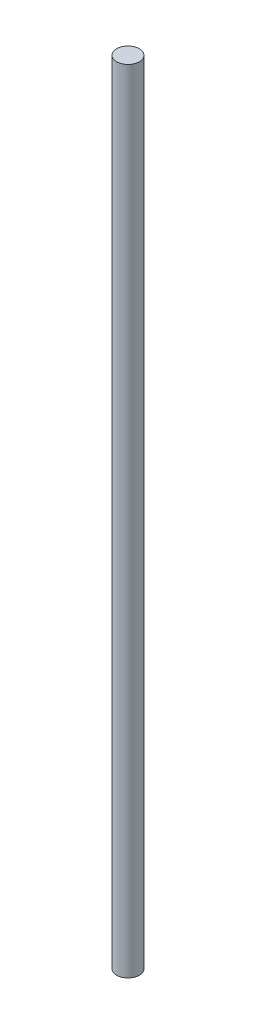
ISO-10303-21;
HEADER;
FILE_DESCRIPTION(('STEP AP214'),'2;1');
FILE_NAME('part.step','',(''),(''),'','','');
FILE_SCHEMA(('AUTOMOTIVE_DESIGN { 1 0 10303 214 1 1 1 1 }'));
ENDSEC;
DATA;
#1=APPLICATION_CONTEXT('core data for automotive mechanical design processes');
#2=APPLICATION_PROTOCOL_DEFINITION('international standard','automotive_design',2000,#1);
#3=PRODUCT_CONTEXT('',#1,'mechanical');
#4=PRODUCT('Part','Part','',(#3));
#5=PRODUCT_RELATED_PRODUCT_CATEGORY('part','',(#4));
#6=PRODUCT_DEFINITION_FORMATION('','',#4);
#7=PRODUCT_DEFINITION_CONTEXT('part definition',#1,'design');
#8=PRODUCT_DEFINITION('design','',#6,#7);
#9=PRODUCT_DEFINITION_SHAPE('','',#8);
#10=(LENGTH_UNIT() NAMED_UNIT(*) SI_UNIT(.MILLI.,.METRE.));
#11=(NAMED_UNIT(*) PLANE_ANGLE_UNIT() SI_UNIT($,.RADIAN.));
#12=(NAMED_UNIT(*) SI_UNIT($,.STERADIAN.) SOLID_ANGLE_UNIT());
#13=UNCERTAINTY_MEASURE_WITH_UNIT(LENGTH_MEASURE(1.E-05),#10,'distance_accuracy_value','');
#14=(GEOMETRIC_REPRESENTATION_CONTEXT(3) GLOBAL_UNCERTAINTY_ASSIGNED_CONTEXT((#13)) GLOBAL_UNIT_ASSIGNED_CONTEXT((#10,
#11,#12)) REPRESENTATION_CONTEXT('',''));
#15=CARTESIAN_POINT('',(0.,0.,0.));
#16=DIRECTION('',(0.,0.,1.));
#17=DIRECTION('',(1.,0.,0.));
#18=AXIS2_PLACEMENT_3D('',#15,#16,#17);
#19=CARTESIAN_POINT('',(0.,210.,0.));
#20=DIRECTION('',(0.,-1.,0.));
#21=DIRECTION('',(0.,0.,-1.));
#22=AXIS2_PLACEMENT_3D('',#19,#20,#21);
#23=CYLINDRICAL_SURFACE('',#22,3.);
#24=CARTESIAN_POINT('',(0.,210.,0.));
#25=DIRECTION('',(0.,1.,0.));
#26=DIRECTION('',(0.,0.,1.));
#27=AXIS2_PLACEMENT_3D('',#24,#25,#26);
#28=CIRCLE('',#27,3.);
#29=CARTESIAN_POINT('',(0.,210.,3.));
#30=VERTEX_POINT('',#29);
#31=EDGE_CURVE('E10',#30,#30,#28,.T.);
#32=ORIENTED_EDGE('',*,*,#31,.F.);
#33=EDGE_LOOP('',(#32));
#34=FACE_BOUND('',#33,.T.);
#35=CARTESIAN_POINT('',(0.,0.,0.));
#36=DIRECTION('',(0.,1.,0.));
#37=DIRECTION('',(0.,0.,1.));
#38=AXIS2_PLACEMENT_3D('',#35,#36,#37);
#39=CIRCLE('',#38,3.);
#40=CARTESIAN_POINT('',(0.,0.,3.));
#41=VERTEX_POINT('',#40);
#42=EDGE_CURVE('E40',#41,#41,#39,.T.);
#43=ORIENTED_EDGE('',*,*,#42,.T.);
#44=EDGE_LOOP('',(#43));
#45=FACE_BOUND('',#44,.T.);
#46=ADVANCED_FACE('F37',(#34,#45),#23,.T.);
#47=CARTESIAN_POINT('',(0.,210.,0.));
#48=DIRECTION('',(0.,1.,0.));
#49=DIRECTION('',(0.,0.,1.));
#50=AXIS2_PLACEMENT_3D('',#47,#48,#49);
#51=PLANE('',#50);
#52=ORIENTED_EDGE('',*,*,#31,.T.);
#53=EDGE_LOOP('',(#52));
#54=FACE_BOUND('',#53,.T.);
#55=ADVANCED_FACE('F54',(#54),#51,.T.);
#56=CARTESIAN_POINT('',(0.,0.,0.));
#57=DIRECTION('',(0.,1.,0.));
#58=DIRECTION('',(0.,0.,1.));
#59=AXIS2_PLACEMENT_3D('',#56,#57,#58);
#60=PLANE('',#59);
#61=ORIENTED_EDGE('',*,*,#42,.F.);
#62=EDGE_LOOP('',(#61));
#63=FACE_BOUND('',#62,.T.);
#64=ADVANCED_FACE('F52',(#63),#60,.F.);
#65=CLOSED_SHELL('',(#46,#55,#64));
#66=MANIFOLD_SOLID_BREP('B2',#65);
#67=ADVANCED_BREP_SHAPE_REPRESENTATION('',(#18,#66),#14);
#68=SHAPE_DEFINITION_REPRESENTATION(#9,#67);
ENDSEC;
END-ISO-10303-21;
